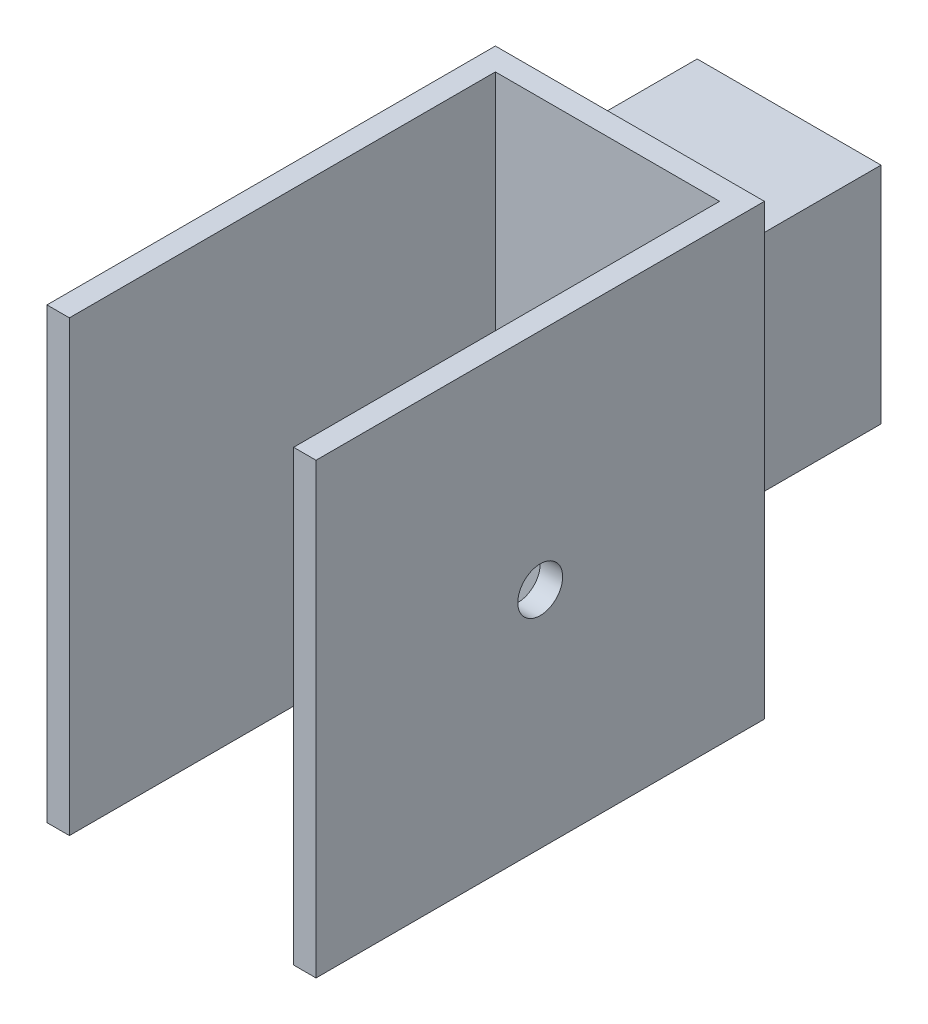
ISO-10303-21;
HEADER;
FILE_DESCRIPTION(('STEP AP214'),'2;1');
FILE_NAME('part.step','',(''),(''),'','','');
FILE_SCHEMA(('AUTOMOTIVE_DESIGN { 1 0 10303 214 1 1 1 1 }'));
ENDSEC;
DATA;
#1=APPLICATION_CONTEXT('core data for automotive mechanical design processes');
#2=APPLICATION_PROTOCOL_DEFINITION('international standard','automotive_design',2000,#1);
#3=PRODUCT_CONTEXT('',#1,'mechanical');
#4=PRODUCT('Part','Part','',(#3));
#5=PRODUCT_RELATED_PRODUCT_CATEGORY('part','',(#4));
#6=PRODUCT_DEFINITION_FORMATION('','',#4);
#7=PRODUCT_DEFINITION_CONTEXT('part definition',#1,'design');
#8=PRODUCT_DEFINITION('design','',#6,#7);
#9=PRODUCT_DEFINITION_SHAPE('','',#8);
#10=(LENGTH_UNIT() NAMED_UNIT(*) SI_UNIT(.MILLI.,.METRE.));
#11=(NAMED_UNIT(*) PLANE_ANGLE_UNIT() SI_UNIT($,.RADIAN.));
#12=(NAMED_UNIT(*) SI_UNIT($,.STERADIAN.) SOLID_ANGLE_UNIT());
#13=UNCERTAINTY_MEASURE_WITH_UNIT(LENGTH_MEASURE(1.E-05),#10,'distance_accuracy_value','');
#14=(GEOMETRIC_REPRESENTATION_CONTEXT(3) GLOBAL_UNCERTAINTY_ASSIGNED_CONTEXT((#13)) GLOBAL_UNIT_ASSIGNED_CONTEXT((#10,
#11,#12)) REPRESENTATION_CONTEXT('',''));
#15=CARTESIAN_POINT('',(0.,0.,0.));
#16=DIRECTION('',(0.,0.,1.));
#17=DIRECTION('',(1.,0.,0.));
#18=AXIS2_PLACEMENT_3D('',#15,#16,#17);
#19=CARTESIAN_POINT('',(0.,0.,0.));
#20=DIRECTION('',(0.,0.,1.));
#21=DIRECTION('',(1.,0.,0.));
#22=AXIS2_PLACEMENT_3D('',#19,#20,#21);
#23=PLANE('',#22);
#24=DIRECTION('',(1.,0.,0.));
#25=VECTOR('',#24,1.);
#26=CARTESIAN_POINT('',(11.,25.,0.));
#27=LINE('',#26,#25);
#28=CARTESIAN_POINT('',(-30.,25.,0.));
#29=VERTEX_POINT('',#28);
#30=CARTESIAN_POINT('',(11.,25.,0.));
#31=VERTEX_POINT('',#30);
#32=EDGE_CURVE('E300',#29,#31,#27,.T.);
#33=ORIENTED_EDGE('',*,*,#32,.F.);
#34=DIRECTION('',(0.,-1.,0.));
#35=VECTOR('',#34,1.);
#36=CARTESIAN_POINT('',(-30.,-50.,0.));
#37=LINE('',#36,#35);
#38=CARTESIAN_POINT('',(-30.,50.,0.));
#39=VERTEX_POINT('',#38);
#40=EDGE_CURVE('E368',#39,#29,#37,.T.);
#41=ORIENTED_EDGE('',*,*,#40,.F.);
#42=DIRECTION('',(-1.,0.,0.));
#43=VECTOR('',#42,1.);
#44=CARTESIAN_POINT('',(30.,50.,0.));
#45=LINE('',#44,#43);
#46=CARTESIAN_POINT('',(30.,50.,0.));
#47=VERTEX_POINT('',#46);
#48=EDGE_CURVE('E357',#47,#39,#45,.T.);
#49=ORIENTED_EDGE('',*,*,#48,.F.);
#50=DIRECTION('',(0.,1.,0.));
#51=VECTOR('',#50,1.);
#52=CARTESIAN_POINT('',(30.,-50.,0.));
#53=LINE('',#52,#51);
#54=CARTESIAN_POINT('',(30.,-50.,0.));
#55=VERTEX_POINT('',#54);
#56=EDGE_CURVE('E373',#55,#47,#53,.T.);
#57=ORIENTED_EDGE('',*,*,#56,.F.);
#58=DIRECTION('',(1.,0.,0.));
#59=VECTOR('',#58,1.);
#60=CARTESIAN_POINT('',(30.,-50.,0.));
#61=LINE('',#60,#59);
#62=CARTESIAN_POINT('',(-30.,-50.,0.));
#63=VERTEX_POINT('',#62);
#64=EDGE_CURVE('E371',#63,#55,#61,.T.);
#65=ORIENTED_EDGE('',*,*,#64,.F.);
#66=CARTESIAN_POINT('',(-30.,-25.,0.));
#67=VERTEX_POINT('',#66);
#68=EDGE_CURVE('E346',#67,#63,#37,.T.);
#69=ORIENTED_EDGE('',*,*,#68,.F.);
#70=DIRECTION('',(-1.,0.,0.));
#71=VECTOR('',#70,1.);
#72=CARTESIAN_POINT('',(11.,-25.,0.));
#73=LINE('',#72,#71);
#74=CARTESIAN_POINT('',(11.,-25.,0.));
#75=VERTEX_POINT('',#74);
#76=EDGE_CURVE('E308',#75,#67,#73,.T.);
#77=ORIENTED_EDGE('',*,*,#76,.F.);
#78=DIRECTION('',(0.,-1.,0.));
#79=VECTOR('',#78,1.);
#80=CARTESIAN_POINT('',(11.,25.,0.));
#81=LINE('',#80,#79);
#82=EDGE_CURVE('E57',#31,#75,#81,.T.);
#83=ORIENTED_EDGE('',*,*,#82,.F.);
#84=EDGE_LOOP('',(#33,#41,#49,#57,#65,#69,#77,#83));
#85=FACE_BOUND('',#84,.T.);
#86=ADVANCED_FACE('F33',(#85),#23,.F.);
#87=CARTESIAN_POINT('',(0.,0.,100.));
#88=DIRECTION('',(0.,0.,1.));
#89=DIRECTION('',(1.,0.,0.));
#90=AXIS2_PLACEMENT_3D('',#87,#88,#89);
#91=PLANE('',#90);
#92=DIRECTION('',(0.,1.,0.));
#93=VECTOR('',#92,1.);
#94=CARTESIAN_POINT('',(-25.,-50.,100.));
#95=LINE('',#94,#93);
#96=CARTESIAN_POINT('',(-25.,-50.,100.));
#97=VERTEX_POINT('',#96);
#98=CARTESIAN_POINT('',(-25.,50.,100.));
#99=VERTEX_POINT('',#98);
#100=EDGE_CURVE('E336',#97,#99,#95,.T.);
#101=ORIENTED_EDGE('',*,*,#100,.T.);
#102=DIRECTION('',(-1.,0.,0.));
#103=VECTOR('',#102,1.);
#104=CARTESIAN_POINT('',(30.,50.,100.));
#105=LINE('',#104,#103);
#106=CARTESIAN_POINT('',(-30.,50.,100.));
#107=VERTEX_POINT('',#106);
#108=EDGE_CURVE('E363',#99,#107,#105,.T.);
#109=ORIENTED_EDGE('',*,*,#108,.T.);
#110=DIRECTION('',(0.,-1.,0.));
#111=VECTOR('',#110,1.);
#112=CARTESIAN_POINT('',(-30.,-50.,100.));
#113=LINE('',#112,#111);
#114=CARTESIAN_POINT('',(-30.,-50.,100.));
#115=VERTEX_POINT('',#114);
#116=EDGE_CURVE('E353',#107,#115,#113,.T.);
#117=ORIENTED_EDGE('',*,*,#116,.T.);
#118=DIRECTION('',(1.,0.,0.));
#119=VECTOR('',#118,1.);
#120=CARTESIAN_POINT('',(30.,-50.,100.));
#121=LINE('',#120,#119);
#122=EDGE_CURVE('E358',#115,#97,#121,.T.);
#123=ORIENTED_EDGE('',*,*,#122,.T.);
#124=EDGE_LOOP('',(#101,#109,#117,#123));
#125=FACE_BOUND('',#124,.T.);
#126=ADVANCED_FACE('F403',(#125),#91,.T.);
#127=CARTESIAN_POINT('',(-30.,-50.,100.));
#128=DIRECTION('',(1.,0.,0.));
#129=DIRECTION('',(0.,0.,-1.));
#130=AXIS2_PLACEMENT_3D('',#127,#128,#129);
#131=PLANE('',#130);
#132=ORIENTED_EDGE('',*,*,#40,.T.);
#133=DIRECTION('',(0.,0.,1.));
#134=VECTOR('',#133,1.);
#135=CARTESIAN_POINT('',(-30.,25.,-45.));
#136=LINE('',#135,#134);
#137=CARTESIAN_POINT('',(-30.,25.,-45.));
#138=VERTEX_POINT('',#137);
#139=EDGE_CURVE('E314',#138,#29,#136,.T.);
#140=ORIENTED_EDGE('',*,*,#139,.F.);
#141=DIRECTION('',(0.,1.,0.));
#142=VECTOR('',#141,1.);
#143=CARTESIAN_POINT('',(-30.,25.,-45.));
#144=LINE('',#143,#142);
#145=CARTESIAN_POINT('',(-30.,-25.,-45.));
#146=VERTEX_POINT('',#145);
#147=EDGE_CURVE('E302',#146,#138,#144,.T.);
#148=ORIENTED_EDGE('',*,*,#147,.F.);
#149=DIRECTION('',(0.,0.,1.));
#150=VECTOR('',#149,1.);
#151=CARTESIAN_POINT('',(-30.,-25.,-45.));
#152=LINE('',#151,#150);
#153=EDGE_CURVE('E317',#146,#67,#152,.T.);
#154=ORIENTED_EDGE('',*,*,#153,.T.);
#155=ORIENTED_EDGE('',*,*,#68,.T.);
#156=DIRECTION('',(0.,0.,-1.));
#157=VECTOR('',#156,1.);
#158=CARTESIAN_POINT('',(-30.,-50.,100.));
#159=LINE('',#158,#157);
#160=EDGE_CURVE('E11',#115,#63,#159,.T.);
#161=ORIENTED_EDGE('',*,*,#160,.F.);
#162=ORIENTED_EDGE('',*,*,#116,.F.);
#163=DIRECTION('',(0.,0.,-1.));
#164=VECTOR('',#163,1.);
#165=CARTESIAN_POINT('',(-30.,50.,100.));
#166=LINE('',#165,#164);
#167=EDGE_CURVE('E367',#107,#39,#166,.T.);
#168=ORIENTED_EDGE('',*,*,#167,.T.);
#169=EDGE_LOOP('',(#132,#140,#148,#154,#155,#161,#162,#168));
#170=FACE_BOUND('',#169,.T.);
#171=ADVANCED_FACE('F35',(#170),#131,.F.);
#172=CARTESIAN_POINT('',(30.,-50.,100.));
#173=DIRECTION('',(0.,1.,0.));
#174=DIRECTION('',(-1.,0.,0.));
#175=AXIS2_PLACEMENT_3D('',#172,#173,#174);
#176=PLANE('',#175);
#177=DIRECTION('',(-1.,0.,0.));
#178=VECTOR('',#177,1.);
#179=CARTESIAN_POINT('',(25.,-50.,5.));
#180=LINE('',#179,#178);
#181=CARTESIAN_POINT('',(25.,-50.,5.));
#182=VERTEX_POINT('',#181);
#183=CARTESIAN_POINT('',(-25.,-50.,5.00000000000001));
#184=VERTEX_POINT('',#183);
#185=EDGE_CURVE('E333',#182,#184,#180,.T.);
#186=ORIENTED_EDGE('',*,*,#185,.T.);
#187=DIRECTION('',(0.,0.,1.));
#188=VECTOR('',#187,1.);
#189=CARTESIAN_POINT('',(-25.,-50.,100.));
#190=LINE('',#189,#188);
#191=EDGE_CURVE('E326',#184,#97,#190,.T.);
#192=ORIENTED_EDGE('',*,*,#191,.T.);
#193=ORIENTED_EDGE('',*,*,#122,.F.);
#194=ORIENTED_EDGE('',*,*,#160,.T.);
#195=ORIENTED_EDGE('',*,*,#64,.T.);
#196=DIRECTION('',(0.,0.,-1.));
#197=VECTOR('',#196,1.);
#198=CARTESIAN_POINT('',(30.,-50.,100.));
#199=LINE('',#198,#197);
#200=CARTESIAN_POINT('',(30.,-50.,100.));
#201=VERTEX_POINT('',#200);
#202=EDGE_CURVE('E42',#201,#55,#199,.T.);
#203=ORIENTED_EDGE('',*,*,#202,.F.);
#204=CARTESIAN_POINT('',(25.,-50.,100.));
#205=VERTEX_POINT('',#204);
#206=EDGE_CURVE('E356',#205,#201,#121,.T.);
#207=ORIENTED_EDGE('',*,*,#206,.F.);
#208=DIRECTION('',(0.,0.,-1.));
#209=VECTOR('',#208,1.);
#210=CARTESIAN_POINT('',(25.,-50.,100.));
#211=LINE('',#210,#209);
#212=EDGE_CURVE('E329',#205,#182,#211,.T.);
#213=ORIENTED_EDGE('',*,*,#212,.T.);
#214=EDGE_LOOP('',(#186,#192,#193,#194,#195,#203,#207,#213));
#215=FACE_BOUND('',#214,.T.);
#216=ADVANCED_FACE('F418',(#215),#176,.F.);
#217=CARTESIAN_POINT('',(30.,-50.,100.));
#218=DIRECTION('',(-1.,0.,0.));
#219=DIRECTION('',(0.,0.,1.));
#220=AXIS2_PLACEMENT_3D('',#217,#218,#219);
#221=PLANE('',#220);
#222=CARTESIAN_POINT('',(30.,0.,50.));
#223=DIRECTION('',(1.,0.,0.));
#224=DIRECTION('',(0.,0.,-1.));
#225=AXIS2_PLACEMENT_3D('',#222,#223,#224);
#226=CIRCLE('',#225,5.);
#227=CARTESIAN_POINT('',(30.,0.,45.));
#228=VERTEX_POINT('',#227);
#229=EDGE_CURVE('E323',#228,#228,#226,.T.);
#230=ORIENTED_EDGE('',*,*,#229,.F.);
#231=EDGE_LOOP('',(#230));
#232=FACE_BOUND('',#231,.T.);
#233=ORIENTED_EDGE('',*,*,#56,.T.);
#234=DIRECTION('',(0.,0.,-1.));
#235=VECTOR('',#234,1.);
#236=CARTESIAN_POINT('',(30.,50.,100.));
#237=LINE('',#236,#235);
#238=CARTESIAN_POINT('',(30.,50.,100.));
#239=VERTEX_POINT('',#238);
#240=EDGE_CURVE('E378',#239,#47,#237,.T.);
#241=ORIENTED_EDGE('',*,*,#240,.F.);
#242=DIRECTION('',(0.,1.,0.));
#243=VECTOR('',#242,1.);
#244=CARTESIAN_POINT('',(30.,-50.,100.));
#245=LINE('',#244,#243);
#246=EDGE_CURVE('E361',#201,#239,#245,.T.);
#247=ORIENTED_EDGE('',*,*,#246,.F.);
#248=ORIENTED_EDGE('',*,*,#202,.T.);
#249=EDGE_LOOP('',(#233,#241,#247,#248));
#250=FACE_BOUND('',#249,.T.);
#251=ADVANCED_FACE('F386',(#232,#250),#221,.F.);
#252=CARTESIAN_POINT('',(30.,50.,100.));
#253=DIRECTION('',(0.,-1.,0.));
#254=DIRECTION('',(1.,0.,0.));
#255=AXIS2_PLACEMENT_3D('',#252,#253,#254);
#256=PLANE('',#255);
#257=ORIENTED_EDGE('',*,*,#108,.F.);
#258=DIRECTION('',(0.,0.,1.));
#259=VECTOR('',#258,1.);
#260=CARTESIAN_POINT('',(-25.,50.,100.));
#261=LINE('',#260,#259);
#262=CARTESIAN_POINT('',(-25.,50.,5.00000000000001));
#263=VERTEX_POINT('',#262);
#264=EDGE_CURVE('E337',#263,#99,#261,.T.);
#265=ORIENTED_EDGE('',*,*,#264,.F.);
#266=DIRECTION('',(-1.,0.,0.));
#267=VECTOR('',#266,1.);
#268=CARTESIAN_POINT('',(25.,50.,5.));
#269=LINE('',#268,#267);
#270=CARTESIAN_POINT('',(25.,50.,5.));
#271=VERTEX_POINT('',#270);
#272=EDGE_CURVE('E330',#271,#263,#269,.T.);
#273=ORIENTED_EDGE('',*,*,#272,.F.);
#274=DIRECTION('',(0.,0.,-1.));
#275=VECTOR('',#274,1.);
#276=CARTESIAN_POINT('',(25.,50.,100.));
#277=LINE('',#276,#275);
#278=CARTESIAN_POINT('',(25.,50.,100.));
#279=VERTEX_POINT('',#278);
#280=EDGE_CURVE('E339',#279,#271,#277,.T.);
#281=ORIENTED_EDGE('',*,*,#280,.F.);
#282=EDGE_CURVE('E364',#239,#279,#105,.T.);
#283=ORIENTED_EDGE('',*,*,#282,.F.);
#284=ORIENTED_EDGE('',*,*,#240,.T.);
#285=ORIENTED_EDGE('',*,*,#48,.T.);
#286=ORIENTED_EDGE('',*,*,#167,.F.);
#287=EDGE_LOOP('',(#257,#265,#273,#281,#283,#284,#285,#286));
#288=FACE_BOUND('',#287,.T.);
#289=ADVANCED_FACE('F396',(#288),#256,.F.);
#290=DIRECTION('',(0.,1.,0.));
#291=VECTOR('',#290,1.);
#292=CARTESIAN_POINT('',(25.,-50.,100.));
#293=LINE('',#292,#291);
#294=EDGE_CURVE('E349',#205,#279,#293,.T.);
#295=ORIENTED_EDGE('',*,*,#294,.F.);
#296=ORIENTED_EDGE('',*,*,#206,.T.);
#297=ORIENTED_EDGE('',*,*,#246,.T.);
#298=ORIENTED_EDGE('',*,*,#282,.T.);
#299=EDGE_LOOP('',(#295,#296,#297,#298));
#300=FACE_BOUND('',#299,.T.);
#301=ADVANCED_FACE('F417',(#300),#91,.T.);
#302=CARTESIAN_POINT('',(-25.,-50.,100.));
#303=DIRECTION('',(-1.,0.,0.));
#304=DIRECTION('',(0.,-1.,0.));
#305=AXIS2_PLACEMENT_3D('',#302,#303,#304);
#306=PLANE('',#305);
#307=ORIENTED_EDGE('',*,*,#264,.T.);
#308=ORIENTED_EDGE('',*,*,#100,.F.);
#309=ORIENTED_EDGE('',*,*,#191,.F.);
#310=DIRECTION('',(0.,1.,0.));
#311=VECTOR('',#310,1.);
#312=CARTESIAN_POINT('',(-25.,-50.,5.00000000000001));
#313=LINE('',#312,#311);
#314=EDGE_CURVE('E344',#184,#263,#313,.T.);
#315=ORIENTED_EDGE('',*,*,#314,.T.);
#316=EDGE_LOOP('',(#307,#308,#309,#315));
#317=FACE_BOUND('',#316,.T.);
#318=ADVANCED_FACE('F408',(#317),#306,.F.);
#319=CARTESIAN_POINT('',(25.,-50.,5.));
#320=DIRECTION('',(0.,0.,-1.));
#321=DIRECTION('',(-1.,0.,0.));
#322=AXIS2_PLACEMENT_3D('',#319,#320,#321);
#323=PLANE('',#322);
#324=ORIENTED_EDGE('',*,*,#272,.T.);
#325=ORIENTED_EDGE('',*,*,#314,.F.);
#326=ORIENTED_EDGE('',*,*,#185,.F.);
#327=DIRECTION('',(0.,1.,0.));
#328=VECTOR('',#327,1.);
#329=CARTESIAN_POINT('',(25.,-50.,5.));
#330=LINE('',#329,#328);
#331=EDGE_CURVE('E347',#182,#271,#330,.T.);
#332=ORIENTED_EDGE('',*,*,#331,.T.);
#333=EDGE_LOOP('',(#324,#325,#326,#332));
#334=FACE_BOUND('',#333,.T.);
#335=ADVANCED_FACE('F412',(#334),#323,.F.);
#336=CARTESIAN_POINT('',(25.,-50.,100.));
#337=DIRECTION('',(1.,0.,0.));
#338=DIRECTION('',(0.,1.,0.));
#339=AXIS2_PLACEMENT_3D('',#336,#337,#338);
#340=PLANE('',#339);
#341=CARTESIAN_POINT('',(25.,0.,50.));
#342=DIRECTION('',(1.,0.,0.));
#343=DIRECTION('',(0.,1.,0.));
#344=AXIS2_PLACEMENT_3D('',#341,#342,#343);
#345=CIRCLE('',#344,5.);
#346=CARTESIAN_POINT('',(25.,5.00000000000001,50.));
#347=VERTEX_POINT('',#346);
#348=EDGE_CURVE('E37',#347,#347,#345,.T.);
#349=ORIENTED_EDGE('',*,*,#348,.T.);
#350=EDGE_LOOP('',(#349));
#351=FACE_BOUND('',#350,.T.);
#352=ORIENTED_EDGE('',*,*,#280,.T.);
#353=ORIENTED_EDGE('',*,*,#331,.F.);
#354=ORIENTED_EDGE('',*,*,#212,.F.);
#355=ORIENTED_EDGE('',*,*,#294,.T.);
#356=EDGE_LOOP('',(#352,#353,#354,#355));
#357=FACE_BOUND('',#356,.T.);
#358=ADVANCED_FACE('F414',(#351,#357),#340,.F.);
#359=CARTESIAN_POINT('',(9.00000000000006,0.,50.));
#360=DIRECTION('',(1.,0.,0.));
#361=DIRECTION('',(0.,0.,-1.));
#362=AXIS2_PLACEMENT_3D('',#359,#360,#361);
#363=CYLINDRICAL_SURFACE('',#362,5.);
#364=ORIENTED_EDGE('',*,*,#229,.T.);
#365=EDGE_LOOP('',(#364));
#366=FACE_BOUND('',#365,.T.);
#367=ORIENTED_EDGE('',*,*,#348,.F.);
#368=EDGE_LOOP('',(#367));
#369=FACE_BOUND('',#368,.T.);
#370=ADVANCED_FACE('F449',(#366,#369),#363,.F.);
#371=CARTESIAN_POINT('',(11.,25.,-45.));
#372=DIRECTION('',(-1.,0.,0.));
#373=DIRECTION('',(0.,-1.,0.));
#374=AXIS2_PLACEMENT_3D('',#371,#372,#373);
#375=PLANE('',#374);
#376=ORIENTED_EDGE('',*,*,#82,.T.);
#377=DIRECTION('',(0.,0.,1.));
#378=VECTOR('',#377,1.);
#379=CARTESIAN_POINT('',(11.,-25.,-45.));
#380=LINE('',#379,#378);
#381=CARTESIAN_POINT('',(11.,-25.,-45.));
#382=VERTEX_POINT('',#381);
#383=EDGE_CURVE('E320',#382,#75,#380,.T.);
#384=ORIENTED_EDGE('',*,*,#383,.F.);
#385=DIRECTION('',(0.,-1.,0.));
#386=VECTOR('',#385,1.);
#387=CARTESIAN_POINT('',(11.,25.,-45.));
#388=LINE('',#387,#386);
#389=CARTESIAN_POINT('',(11.,25.,-45.));
#390=VERTEX_POINT('',#389);
#391=EDGE_CURVE('E296',#390,#382,#388,.T.);
#392=ORIENTED_EDGE('',*,*,#391,.F.);
#393=DIRECTION('',(0.,0.,1.));
#394=VECTOR('',#393,1.);
#395=CARTESIAN_POINT('',(11.,25.,-45.));
#396=LINE('',#395,#394);
#397=EDGE_CURVE('E306',#390,#31,#396,.T.);
#398=ORIENTED_EDGE('',*,*,#397,.T.);
#399=EDGE_LOOP('',(#376,#384,#392,#398));
#400=FACE_BOUND('',#399,.T.);
#401=ADVANCED_FACE('F454',(#400),#375,.F.);
#402=CARTESIAN_POINT('',(11.,-25.,-45.));
#403=DIRECTION('',(0.,1.,0.));
#404=DIRECTION('',(-1.,0.,0.));
#405=AXIS2_PLACEMENT_3D('',#402,#403,#404);
#406=PLANE('',#405);
#407=ORIENTED_EDGE('',*,*,#76,.T.);
#408=ORIENTED_EDGE('',*,*,#153,.F.);
#409=DIRECTION('',(-1.,0.,0.));
#410=VECTOR('',#409,1.);
#411=CARTESIAN_POINT('',(11.,-25.,-45.));
#412=LINE('',#411,#410);
#413=EDGE_CURVE('E299',#382,#146,#412,.T.);
#414=ORIENTED_EDGE('',*,*,#413,.F.);
#415=ORIENTED_EDGE('',*,*,#383,.T.);
#416=EDGE_LOOP('',(#407,#408,#414,#415));
#417=FACE_BOUND('',#416,.T.);
#418=ADVANCED_FACE('F458',(#417),#406,.F.);
#419=CARTESIAN_POINT('',(11.,25.,-45.));
#420=DIRECTION('',(0.,-1.,0.));
#421=DIRECTION('',(0.,0.,-1.));
#422=AXIS2_PLACEMENT_3D('',#419,#420,#421);
#423=PLANE('',#422);
#424=ORIENTED_EDGE('',*,*,#32,.T.);
#425=ORIENTED_EDGE('',*,*,#397,.F.);
#426=DIRECTION('',(1.,0.,0.));
#427=VECTOR('',#426,1.);
#428=CARTESIAN_POINT('',(11.,25.,-45.));
#429=LINE('',#428,#427);
#430=EDGE_CURVE('E304',#138,#390,#429,.T.);
#431=ORIENTED_EDGE('',*,*,#430,.F.);
#432=ORIENTED_EDGE('',*,*,#139,.T.);
#433=EDGE_LOOP('',(#424,#425,#431,#432));
#434=FACE_BOUND('',#433,.T.);
#435=ADVANCED_FACE('F462',(#434),#423,.F.);
#436=CARTESIAN_POINT('',(0.,0.,-45.));
#437=DIRECTION('',(0.,0.,-1.));
#438=DIRECTION('',(-1.,0.,0.));
#439=AXIS2_PLACEMENT_3D('',#436,#437,#438);
#440=PLANE('',#439);
#441=DIRECTION('',(0.,-1.,0.));
#442=VECTOR('',#441,1.);
#443=CARTESIAN_POINT('',(9.,25.,-45.));
#444=LINE('',#443,#442);
#445=CARTESIAN_POINT('',(9.,23.,-45.));
#446=VERTEX_POINT('',#445);
#447=CARTESIAN_POINT('',(9.,-23.,-45.));
#448=VERTEX_POINT('',#447);
#449=EDGE_CURVE('E201',#446,#448,#444,.T.);
#450=ORIENTED_EDGE('',*,*,#449,.F.);
#451=DIRECTION('',(1.,0.,0.));
#452=VECTOR('',#451,1.);
#453=CARTESIAN_POINT('',(11.,23.,-45.));
#454=LINE('',#453,#452);
#455=CARTESIAN_POINT('',(-28.,23.,-45.));
#456=VERTEX_POINT('',#455);
#457=EDGE_CURVE('E225',#456,#446,#454,.T.);
#458=ORIENTED_EDGE('',*,*,#457,.F.);
#459=DIRECTION('',(0.,1.,0.));
#460=VECTOR('',#459,1.);
#461=CARTESIAN_POINT('',(-28.,-50.,-45.));
#462=LINE('',#461,#460);
#463=CARTESIAN_POINT('',(-28.,-23.,-45.));
#464=VERTEX_POINT('',#463);
#465=EDGE_CURVE('E218',#464,#456,#462,.T.);
#466=ORIENTED_EDGE('',*,*,#465,.F.);
#467=DIRECTION('',(-1.,0.,0.));
#468=VECTOR('',#467,1.);
#469=CARTESIAN_POINT('',(11.,-23.,-45.));
#470=LINE('',#469,#468);
#471=EDGE_CURVE('E292',#448,#464,#470,.T.);
#472=ORIENTED_EDGE('',*,*,#471,.F.);
#473=EDGE_LOOP('',(#450,#458,#466,#472));
#474=FACE_BOUND('',#473,.T.);
#475=ORIENTED_EDGE('',*,*,#391,.T.);
#476=ORIENTED_EDGE('',*,*,#413,.T.);
#477=ORIENTED_EDGE('',*,*,#147,.T.);
#478=ORIENTED_EDGE('',*,*,#430,.T.);
#479=EDGE_LOOP('',(#475,#476,#477,#478));
#480=FACE_BOUND('',#479,.T.);
#481=ADVANCED_FACE('F466',(#474,#480),#440,.T.);
#482=CARTESIAN_POINT('',(0.,0.,2.));
#483=DIRECTION('',(0.,0.,1.));
#484=DIRECTION('',(1.,0.,0.));
#485=AXIS2_PLACEMENT_3D('',#482,#483,#484);
#486=PLANE('',#485);
#487=DIRECTION('',(1.,0.,0.));
#488=VECTOR('',#487,1.);
#489=CARTESIAN_POINT('',(0.,23.,2.));
#490=LINE('',#489,#488);
#491=CARTESIAN_POINT('',(-28.,23.,2.));
#492=VERTEX_POINT('',#491);
#493=CARTESIAN_POINT('',(9.,23.,2.));
#494=VERTEX_POINT('',#493);
#495=EDGE_CURVE('E194',#492,#494,#490,.T.);
#496=ORIENTED_EDGE('',*,*,#495,.T.);
#497=DIRECTION('',(0.,-1.,0.));
#498=VECTOR('',#497,1.);
#499=CARTESIAN_POINT('',(9.,0.,2.));
#500=LINE('',#499,#498);
#501=CARTESIAN_POINT('',(9.,-23.,2.));
#502=VERTEX_POINT('',#501);
#503=EDGE_CURVE('E228',#494,#502,#500,.T.);
#504=ORIENTED_EDGE('',*,*,#503,.T.);
#505=DIRECTION('',(-1.,0.,0.));
#506=VECTOR('',#505,1.);
#507=CARTESIAN_POINT('',(0.,-23.,2.));
#508=LINE('',#507,#506);
#509=CARTESIAN_POINT('',(-28.,-23.,2.));
#510=VERTEX_POINT('',#509);
#511=EDGE_CURVE('E202',#502,#510,#508,.T.);
#512=ORIENTED_EDGE('',*,*,#511,.T.);
#513=DIRECTION('',(0.,-1.,0.));
#514=VECTOR('',#513,1.);
#515=CARTESIAN_POINT('',(-28.,-50.,2.));
#516=LINE('',#515,#514);
#517=CARTESIAN_POINT('',(-28.,-48.,2.));
#518=VERTEX_POINT('',#517);
#519=EDGE_CURVE('E213',#510,#518,#516,.T.);
#520=ORIENTED_EDGE('',*,*,#519,.T.);
#521=DIRECTION('',(1.,0.,0.));
#522=VECTOR('',#521,1.);
#523=CARTESIAN_POINT('',(30.,-48.,2.));
#524=LINE('',#523,#522);
#525=CARTESIAN_POINT('',(28.,-48.,2.));
#526=VERTEX_POINT('',#525);
#527=EDGE_CURVE('E212',#518,#526,#524,.T.);
#528=ORIENTED_EDGE('',*,*,#527,.T.);
#529=DIRECTION('',(0.,1.,0.));
#530=VECTOR('',#529,1.);
#531=CARTESIAN_POINT('',(28.,-50.,2.));
#532=LINE('',#531,#530);
#533=CARTESIAN_POINT('',(28.,48.,2.));
#534=VERTEX_POINT('',#533);
#535=EDGE_CURVE('E696',#526,#534,#532,.T.);
#536=ORIENTED_EDGE('',*,*,#535,.T.);
#537=DIRECTION('',(-1.,0.,0.));
#538=VECTOR('',#537,1.);
#539=CARTESIAN_POINT('',(30.,48.,2.));
#540=LINE('',#539,#538);
#541=CARTESIAN_POINT('',(-28.,48.,2.));
#542=VERTEX_POINT('',#541);
#543=EDGE_CURVE('E208',#534,#542,#540,.T.);
#544=ORIENTED_EDGE('',*,*,#543,.T.);
#545=DIRECTION('',(0.,-1.,0.));
#546=VECTOR('',#545,1.);
#547=CARTESIAN_POINT('',(-28.,-50.,2.));
#548=LINE('',#547,#546);
#549=EDGE_CURVE('E205',#542,#492,#548,.T.);
#550=ORIENTED_EDGE('',*,*,#549,.T.);
#551=EDGE_LOOP('',(#496,#504,#512,#520,#528,#536,#544,#550));
#552=FACE_BOUND('',#551,.T.);
#553=ADVANCED_FACE('F206',(#552),#486,.T.);
#554=CARTESIAN_POINT('',(0.,0.,98.));
#555=DIRECTION('',(0.,0.,1.));
#556=DIRECTION('',(1.,0.,0.));
#557=AXIS2_PLACEMENT_3D('',#554,#555,#556);
#558=PLANE('',#557);
#559=DIRECTION('',(0.,1.,0.));
#560=VECTOR('',#559,1.);
#561=CARTESIAN_POINT('',(-27.,-50.,98.));
#562=LINE('',#561,#560);
#563=CARTESIAN_POINT('',(-27.,-48.,98.));
#564=VERTEX_POINT('',#563);
#565=CARTESIAN_POINT('',(-27.,48.,98.));
#566=VERTEX_POINT('',#565);
#567=EDGE_CURVE('E243',#564,#566,#562,.T.);
#568=ORIENTED_EDGE('',*,*,#567,.F.);
#569=DIRECTION('',(1.,0.,0.));
#570=VECTOR('',#569,1.);
#571=CARTESIAN_POINT('',(30.,-48.,98.));
#572=LINE('',#571,#570);
#573=CARTESIAN_POINT('',(-28.,-48.,98.));
#574=VERTEX_POINT('',#573);
#575=EDGE_CURVE('E251',#574,#564,#572,.T.);
#576=ORIENTED_EDGE('',*,*,#575,.F.);
#577=DIRECTION('',(0.,-1.,0.));
#578=VECTOR('',#577,1.);
#579=CARTESIAN_POINT('',(-28.,-50.,98.));
#580=LINE('',#579,#578);
#581=CARTESIAN_POINT('',(-28.,48.,98.));
#582=VERTEX_POINT('',#581);
#583=EDGE_CURVE('E235',#582,#574,#580,.T.);
#584=ORIENTED_EDGE('',*,*,#583,.F.);
#585=DIRECTION('',(-1.,0.,0.));
#586=VECTOR('',#585,1.);
#587=CARTESIAN_POINT('',(30.,48.,98.));
#588=LINE('',#587,#586);
#589=EDGE_CURVE('E248',#566,#582,#588,.T.);
#590=ORIENTED_EDGE('',*,*,#589,.F.);
#591=EDGE_LOOP('',(#568,#576,#584,#590));
#592=FACE_BOUND('',#591,.T.);
#593=ADVANCED_FACE('F512',(#592),#558,.F.);
#594=CARTESIAN_POINT('',(-28.,-50.,100.));
#595=DIRECTION('',(1.,0.,0.));
#596=DIRECTION('',(0.,0.,-1.));
#597=AXIS2_PLACEMENT_3D('',#594,#595,#596);
#598=PLANE('',#597);
#599=ORIENTED_EDGE('',*,*,#549,.F.);
#600=DIRECTION('',(0.,0.,-1.));
#601=VECTOR('',#600,1.);
#602=CARTESIAN_POINT('',(-28.,48.,100.));
#603=LINE('',#602,#601);
#604=EDGE_CURVE('E239',#582,#542,#603,.T.);
#605=ORIENTED_EDGE('',*,*,#604,.F.);
#606=ORIENTED_EDGE('',*,*,#583,.T.);
#607=DIRECTION('',(0.,0.,-1.));
#608=VECTOR('',#607,1.);
#609=CARTESIAN_POINT('',(-28.,-48.,100.));
#610=LINE('',#609,#608);
#611=EDGE_CURVE('E231',#574,#518,#610,.T.);
#612=ORIENTED_EDGE('',*,*,#611,.T.);
#613=ORIENTED_EDGE('',*,*,#519,.F.);
#614=DIRECTION('',(0.,0.,1.));
#615=VECTOR('',#614,1.);
#616=CARTESIAN_POINT('',(-28.,-23.,100.));
#617=LINE('',#616,#615);
#618=EDGE_CURVE('E220',#464,#510,#617,.T.);
#619=ORIENTED_EDGE('',*,*,#618,.F.);
#620=ORIENTED_EDGE('',*,*,#465,.T.);
#621=DIRECTION('',(0.,0.,1.));
#622=VECTOR('',#621,1.);
#623=CARTESIAN_POINT('',(-28.,23.,-45.));
#624=LINE('',#623,#622);
#625=EDGE_CURVE('E49',#456,#492,#624,.T.);
#626=ORIENTED_EDGE('',*,*,#625,.T.);
#627=EDGE_LOOP('',(#599,#605,#606,#612,#613,#619,#620,#626));
#628=FACE_BOUND('',#627,.T.);
#629=ADVANCED_FACE('F215',(#628),#598,.T.);
#630=CARTESIAN_POINT('',(30.,-48.,100.));
#631=DIRECTION('',(0.,1.,0.));
#632=DIRECTION('',(-1.,0.,0.));
#633=AXIS2_PLACEMENT_3D('',#630,#631,#632);
#634=PLANE('',#633);
#635=DIRECTION('',(-1.,0.,0.));
#636=VECTOR('',#635,1.);
#637=CARTESIAN_POINT('',(30.,-48.,3.));
#638=LINE('',#637,#636);
#639=CARTESIAN_POINT('',(27.,-48.,3.));
#640=VERTEX_POINT('',#639);
#641=CARTESIAN_POINT('',(-27.,-48.,3.00000000000001));
#642=VERTEX_POINT('',#641);
#643=EDGE_CURVE('E247',#640,#642,#638,.T.);
#644=ORIENTED_EDGE('',*,*,#643,.F.);
#645=DIRECTION('',(0.,0.,-1.));
#646=VECTOR('',#645,1.);
#647=CARTESIAN_POINT('',(27.,-48.,100.));
#648=LINE('',#647,#646);
#649=CARTESIAN_POINT('',(27.,-48.,98.));
#650=VERTEX_POINT('',#649);
#651=EDGE_CURVE('E256',#650,#640,#648,.T.);
#652=ORIENTED_EDGE('',*,*,#651,.F.);
#653=DIRECTION('',(1.,0.,0.));
#654=VECTOR('',#653,1.);
#655=CARTESIAN_POINT('',(30.,-48.,98.));
#656=LINE('',#655,#654);
#657=CARTESIAN_POINT('',(28.,-48.,98.));
#658=VERTEX_POINT('',#657);
#659=EDGE_CURVE('E238',#650,#658,#656,.T.);
#660=ORIENTED_EDGE('',*,*,#659,.T.);
#661=DIRECTION('',(0.,0.,-1.));
#662=VECTOR('',#661,1.);
#663=CARTESIAN_POINT('',(28.,-48.,100.));
#664=LINE('',#663,#662);
#665=EDGE_CURVE('E234',#658,#526,#664,.T.);
#666=ORIENTED_EDGE('',*,*,#665,.T.);
#667=ORIENTED_EDGE('',*,*,#527,.F.);
#668=ORIENTED_EDGE('',*,*,#611,.F.);
#669=ORIENTED_EDGE('',*,*,#575,.T.);
#670=DIRECTION('',(0.,0.,1.));
#671=VECTOR('',#670,1.);
#672=CARTESIAN_POINT('',(-27.,-48.,100.));
#673=LINE('',#672,#671);
#674=EDGE_CURVE('E257',#642,#564,#673,.T.);
#675=ORIENTED_EDGE('',*,*,#674,.F.);
#676=EDGE_LOOP('',(#644,#652,#660,#666,#667,#668,#669,#675));
#677=FACE_BOUND('',#676,.T.);
#678=ADVANCED_FACE('F505',(#677),#634,.T.);
#679=CARTESIAN_POINT('',(28.,-50.,100.));
#680=DIRECTION('',(-1.,0.,0.));
#681=DIRECTION('',(0.,0.,1.));
#682=AXIS2_PLACEMENT_3D('',#679,#680,#681);
#683=PLANE('',#682);
#684=CARTESIAN_POINT('',(28.,0.,50.));
#685=DIRECTION('',(-1.,0.,0.));
#686=DIRECTION('',(0.,0.,1.));
#687=AXIS2_PLACEMENT_3D('',#684,#685,#686);
#688=CIRCLE('',#687,7.);
#689=CARTESIAN_POINT('',(28.,0.,57.));
#690=VERTEX_POINT('',#689);
#691=EDGE_CURVE('E266',#690,#690,#688,.F.);
#692=ORIENTED_EDGE('',*,*,#691,.T.);
#693=EDGE_LOOP('',(#692));
#694=FACE_BOUND('',#693,.T.);
#695=ORIENTED_EDGE('',*,*,#535,.F.);
#696=ORIENTED_EDGE('',*,*,#665,.F.);
#697=DIRECTION('',(0.,1.,0.));
#698=VECTOR('',#697,1.);
#699=CARTESIAN_POINT('',(28.,-50.,98.));
#700=LINE('',#699,#698);
#701=CARTESIAN_POINT('',(28.,48.,98.));
#702=VERTEX_POINT('',#701);
#703=EDGE_CURVE('E250',#658,#702,#700,.T.);
#704=ORIENTED_EDGE('',*,*,#703,.T.);
#705=DIRECTION('',(0.,0.,-1.));
#706=VECTOR('',#705,1.);
#707=CARTESIAN_POINT('',(28.,48.,100.));
#708=LINE('',#707,#706);
#709=EDGE_CURVE('E241',#702,#534,#708,.T.);
#710=ORIENTED_EDGE('',*,*,#709,.T.);
#711=EDGE_LOOP('',(#695,#696,#704,#710));
#712=FACE_BOUND('',#711,.T.);
#713=ADVANCED_FACE('F501',(#694,#712),#683,.T.);
#714=CARTESIAN_POINT('',(30.,48.,100.));
#715=DIRECTION('',(0.,-1.,0.));
#716=DIRECTION('',(1.,0.,0.));
#717=AXIS2_PLACEMENT_3D('',#714,#715,#716);
#718=PLANE('',#717);
#719=ORIENTED_EDGE('',*,*,#589,.T.);
#720=ORIENTED_EDGE('',*,*,#604,.T.);
#721=ORIENTED_EDGE('',*,*,#543,.F.);
#722=ORIENTED_EDGE('',*,*,#709,.F.);
#723=DIRECTION('',(-1.,0.,0.));
#724=VECTOR('',#723,1.);
#725=CARTESIAN_POINT('',(30.,48.,98.));
#726=LINE('',#725,#724);
#727=CARTESIAN_POINT('',(27.,48.,98.));
#728=VERTEX_POINT('',#727);
#729=EDGE_CURVE('E242',#702,#728,#726,.T.);
#730=ORIENTED_EDGE('',*,*,#729,.T.);
#731=DIRECTION('',(0.,0.,-1.));
#732=VECTOR('',#731,1.);
#733=CARTESIAN_POINT('',(27.,48.,100.));
#734=LINE('',#733,#732);
#735=CARTESIAN_POINT('',(27.,48.,3.));
#736=VERTEX_POINT('',#735);
#737=EDGE_CURVE('E275',#728,#736,#734,.T.);
#738=ORIENTED_EDGE('',*,*,#737,.T.);
#739=DIRECTION('',(-1.,0.,0.));
#740=VECTOR('',#739,1.);
#741=CARTESIAN_POINT('',(25.,48.,3.));
#742=LINE('',#741,#740);
#743=CARTESIAN_POINT('',(-27.,48.,3.00000000000001));
#744=VERTEX_POINT('',#743);
#745=EDGE_CURVE('E260',#736,#744,#742,.T.);
#746=ORIENTED_EDGE('',*,*,#745,.T.);
#747=DIRECTION('',(0.,0.,1.));
#748=VECTOR('',#747,1.);
#749=CARTESIAN_POINT('',(-27.,48.,100.));
#750=LINE('',#749,#748);
#751=EDGE_CURVE('E273',#744,#566,#750,.T.);
#752=ORIENTED_EDGE('',*,*,#751,.T.);
#753=EDGE_LOOP('',(#719,#720,#721,#722,#730,#738,#746,#752));
#754=FACE_BOUND('',#753,.T.);
#755=ADVANCED_FACE('F498',(#754),#718,.T.);
#756=DIRECTION('',(0.,1.,0.));
#757=VECTOR('',#756,1.);
#758=CARTESIAN_POINT('',(27.,0.,98.));
#759=LINE('',#758,#757);
#760=EDGE_CURVE('E246',#650,#728,#759,.T.);
#761=ORIENTED_EDGE('',*,*,#760,.T.);
#762=ORIENTED_EDGE('',*,*,#729,.F.);
#763=ORIENTED_EDGE('',*,*,#703,.F.);
#764=ORIENTED_EDGE('',*,*,#659,.F.);
#765=EDGE_LOOP('',(#761,#762,#763,#764));
#766=FACE_BOUND('',#765,.T.);
#767=ADVANCED_FACE('F496',(#766),#558,.F.);
#768=CARTESIAN_POINT('',(-27.,-50.,100.));
#769=DIRECTION('',(-1.,0.,0.));
#770=DIRECTION('',(0.,-1.,0.));
#771=AXIS2_PLACEMENT_3D('',#768,#769,#770);
#772=PLANE('',#771);
#773=ORIENTED_EDGE('',*,*,#751,.F.);
#774=DIRECTION('',(0.,1.,0.));
#775=VECTOR('',#774,1.);
#776=CARTESIAN_POINT('',(-27.,-50.,3.00000000000001));
#777=LINE('',#776,#775);
#778=EDGE_CURVE('E287',#642,#744,#777,.T.);
#779=ORIENTED_EDGE('',*,*,#778,.F.);
#780=ORIENTED_EDGE('',*,*,#674,.T.);
#781=ORIENTED_EDGE('',*,*,#567,.T.);
#782=EDGE_LOOP('',(#773,#779,#780,#781));
#783=FACE_BOUND('',#782,.T.);
#784=ADVANCED_FACE('F492',(#783),#772,.T.);
#785=CARTESIAN_POINT('',(25.,-50.,3.));
#786=DIRECTION('',(0.,0.,-1.));
#787=DIRECTION('',(-1.,0.,0.));
#788=AXIS2_PLACEMENT_3D('',#785,#786,#787);
#789=PLANE('',#788);
#790=ORIENTED_EDGE('',*,*,#745,.F.);
#791=DIRECTION('',(0.,1.,0.));
#792=VECTOR('',#791,1.);
#793=CARTESIAN_POINT('',(27.,-50.,3.));
#794=LINE('',#793,#792);
#795=EDGE_CURVE('E283',#640,#736,#794,.T.);
#796=ORIENTED_EDGE('',*,*,#795,.F.);
#797=ORIENTED_EDGE('',*,*,#643,.T.);
#798=ORIENTED_EDGE('',*,*,#778,.T.);
#799=EDGE_LOOP('',(#790,#796,#797,#798));
#800=FACE_BOUND('',#799,.T.);
#801=ADVANCED_FACE('F488',(#800),#789,.T.);
#802=CARTESIAN_POINT('',(27.,-50.,100.));
#803=DIRECTION('',(1.,0.,0.));
#804=DIRECTION('',(0.,1.,0.));
#805=AXIS2_PLACEMENT_3D('',#802,#803,#804);
#806=PLANE('',#805);
#807=CARTESIAN_POINT('',(27.,0.,50.));
#808=DIRECTION('',(1.,0.,0.));
#809=DIRECTION('',(0.,1.,0.));
#810=AXIS2_PLACEMENT_3D('',#807,#808,#809);
#811=CIRCLE('',#810,7.);
#812=CARTESIAN_POINT('',(27.,7.00000000000001,50.));
#813=VERTEX_POINT('',#812);
#814=EDGE_CURVE('E269',#813,#813,#811,.T.);
#815=ORIENTED_EDGE('',*,*,#814,.F.);
#816=EDGE_LOOP('',(#815));
#817=FACE_BOUND('',#816,.T.);
#818=ORIENTED_EDGE('',*,*,#737,.F.);
#819=ORIENTED_EDGE('',*,*,#760,.F.);
#820=ORIENTED_EDGE('',*,*,#651,.T.);
#821=ORIENTED_EDGE('',*,*,#795,.T.);
#822=EDGE_LOOP('',(#818,#819,#820,#821));
#823=FACE_BOUND('',#822,.T.);
#824=ADVANCED_FACE('F484',(#817,#823),#806,.T.);
#825=CARTESIAN_POINT('',(9.00000000000006,0.,50.));
#826=DIRECTION('',(1.,0.,0.));
#827=DIRECTION('',(0.,0.,-1.));
#828=AXIS2_PLACEMENT_3D('',#825,#826,#827);
#829=CYLINDRICAL_SURFACE('',#828,7.);
#830=ORIENTED_EDGE('',*,*,#691,.F.);
#831=EDGE_LOOP('',(#830));
#832=FACE_BOUND('',#831,.T.);
#833=ORIENTED_EDGE('',*,*,#814,.T.);
#834=EDGE_LOOP('',(#833));
#835=FACE_BOUND('',#834,.T.);
#836=ADVANCED_FACE('F480',(#832,#835),#829,.T.);
#837=CARTESIAN_POINT('',(9.,25.,-45.));
#838=DIRECTION('',(-1.,0.,0.));
#839=DIRECTION('',(0.,-1.,0.));
#840=AXIS2_PLACEMENT_3D('',#837,#838,#839);
#841=PLANE('',#840);
#842=ORIENTED_EDGE('',*,*,#503,.F.);
#843=DIRECTION('',(0.,0.,1.));
#844=VECTOR('',#843,1.);
#845=CARTESIAN_POINT('',(9.,23.,-45.));
#846=LINE('',#845,#844);
#847=EDGE_CURVE('E198',#446,#494,#846,.T.);
#848=ORIENTED_EDGE('',*,*,#847,.F.);
#849=ORIENTED_EDGE('',*,*,#449,.T.);
#850=DIRECTION('',(0.,0.,1.));
#851=VECTOR('',#850,1.);
#852=CARTESIAN_POINT('',(9.,-23.,-45.));
#853=LINE('',#852,#851);
#854=EDGE_CURVE('E223',#448,#502,#853,.T.);
#855=ORIENTED_EDGE('',*,*,#854,.T.);
#856=EDGE_LOOP('',(#842,#848,#849,#855));
#857=FACE_BOUND('',#856,.T.);
#858=ADVANCED_FACE('F476',(#857),#841,.T.);
#859=CARTESIAN_POINT('',(11.,-23.,-45.));
#860=DIRECTION('',(0.,1.,0.));
#861=DIRECTION('',(-1.,0.,0.));
#862=AXIS2_PLACEMENT_3D('',#859,#860,#861);
#863=PLANE('',#862);
#864=ORIENTED_EDGE('',*,*,#511,.F.);
#865=ORIENTED_EDGE('',*,*,#854,.F.);
#866=ORIENTED_EDGE('',*,*,#471,.T.);
#867=ORIENTED_EDGE('',*,*,#618,.T.);
#868=EDGE_LOOP('',(#864,#865,#866,#867));
#869=FACE_BOUND('',#868,.T.);
#870=ADVANCED_FACE('F473',(#869),#863,.T.);
#871=CARTESIAN_POINT('',(11.,23.,-45.));
#872=DIRECTION('',(0.,-1.,0.));
#873=DIRECTION('',(0.,0.,-1.));
#874=AXIS2_PLACEMENT_3D('',#871,#872,#873);
#875=PLANE('',#874);
#876=ORIENTED_EDGE('',*,*,#495,.F.);
#877=ORIENTED_EDGE('',*,*,#625,.F.);
#878=ORIENTED_EDGE('',*,*,#457,.T.);
#879=ORIENTED_EDGE('',*,*,#847,.T.);
#880=EDGE_LOOP('',(#876,#877,#878,#879));
#881=FACE_BOUND('',#880,.T.);
#882=ADVANCED_FACE('F196',(#881),#875,.T.);
#883=CLOSED_SHELL('',(#86,#126,#171,#216,#251,#289,#301,#318,#335,#358,#370,#401,#418,#435,#481,
#553,#593,#629,#678,#713,#755,#767,#784,#801,#824,#836,#858,#870,#882));
#884=MANIFOLD_SOLID_BREP('B2',#883);
#885=ADVANCED_BREP_SHAPE_REPRESENTATION('',(#18,#884),#14);
#886=SHAPE_DEFINITION_REPRESENTATION(#9,#885);
ENDSEC;
END-ISO-10303-21;
